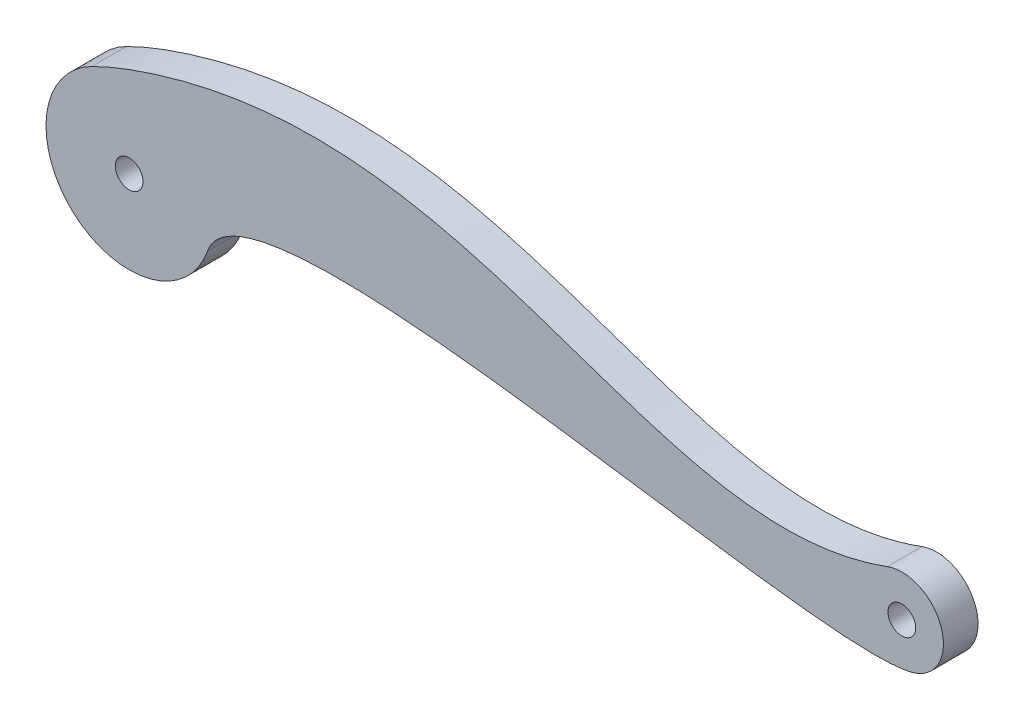
ISO-10303-21;
HEADER;
FILE_DESCRIPTION(('STEP AP214'),'2;1');
FILE_NAME('part.step','',(''),(''),'','','');
FILE_SCHEMA(('AUTOMOTIVE_DESIGN { 1 0 10303 214 1 1 1 1 }'));
ENDSEC;
DATA;
#1=APPLICATION_CONTEXT('core data for automotive mechanical design processes');
#2=APPLICATION_PROTOCOL_DEFINITION('international standard','automotive_design',2000,#1);
#3=PRODUCT_CONTEXT('',#1,'mechanical');
#4=PRODUCT('Part','Part','',(#3));
#5=PRODUCT_RELATED_PRODUCT_CATEGORY('part','',(#4));
#6=PRODUCT_DEFINITION_FORMATION('','',#4);
#7=PRODUCT_DEFINITION_CONTEXT('part definition',#1,'design');
#8=PRODUCT_DEFINITION('design','',#6,#7);
#9=PRODUCT_DEFINITION_SHAPE('','',#8);
#10=(LENGTH_UNIT() NAMED_UNIT(*) SI_UNIT(.MILLI.,.METRE.));
#11=(NAMED_UNIT(*) PLANE_ANGLE_UNIT() SI_UNIT($,.RADIAN.));
#12=(NAMED_UNIT(*) SI_UNIT($,.STERADIAN.) SOLID_ANGLE_UNIT());
#13=UNCERTAINTY_MEASURE_WITH_UNIT(LENGTH_MEASURE(1.E-05),#10,'distance_accuracy_value','');
#14=(GEOMETRIC_REPRESENTATION_CONTEXT(3) GLOBAL_UNCERTAINTY_ASSIGNED_CONTEXT((#13)) GLOBAL_UNIT_ASSIGNED_CONTEXT((#10,
#11,#12)) REPRESENTATION_CONTEXT('',''));
#15=CARTESIAN_POINT('',(0.,0.,0.));
#16=DIRECTION('',(0.,0.,1.));
#17=DIRECTION('',(1.,0.,0.));
#18=AXIS2_PLACEMENT_3D('',#15,#16,#17);
#19=CARTESIAN_POINT('',(-5.38620887722903,10.7232809312663,5.));
#20=CARTESIAN_POINT('',(-2.84461960461294,11.9998986744907,5.));
#21=CARTESIAN_POINT('',(48.946707062239,31.7787395732621,5.));
#22=CARTESIAN_POINT('',(75.6738362485072,-6.86382521144127,5.));
#23=CARTESIAN_POINT('',(109.417114302078,5.62686299543467,5.));
#24=B_SPLINE_CURVE_WITH_KNOTS('',3,(#19,#20,#21,#22,#23),.UNSPECIFIED.,.F.,.F.,(4,1,4),(0.,
0.0365584304062921,0.73116860812584),.UNSPECIFIED.);
#25=DIRECTION('',(0.,0.,-1.));
#26=VECTOR('',#25,1.);
#27=SURFACE_OF_LINEAR_EXTRUSION('',#24,#26);
#28=CARTESIAN_POINT('',(-5.38620887722903,10.7232809312663,0.));
#29=CARTESIAN_POINT('',(-2.84461960461294,11.9998986744907,0.));
#30=CARTESIAN_POINT('',(48.946707062239,31.7787395732621,0.));
#31=CARTESIAN_POINT('',(75.6738362485072,-6.86382521144127,0.));
#32=CARTESIAN_POINT('',(109.417114302078,5.62686299543467,0.));
#33=B_SPLINE_CURVE_WITH_KNOTS('',3,(#28,#29,#30,#31,#32),.UNSPECIFIED.,.F.,.F.,(4,1,4),(0.,
0.0365584304062921,0.73116860812584),.UNSPECIFIED.);
#34=CARTESIAN_POINT('',(-5.38620887722903,10.7232809312663,0.));
#35=VERTEX_POINT('',#34);
#36=CARTESIAN_POINT('',(109.417114302078,5.62686299543466,0.));
#37=VERTEX_POINT('',#36);
#38=EDGE_CURVE('E121',#35,#37,#33,.T.);
#39=ORIENTED_EDGE('',*,*,#38,.F.);
#40=DIRECTION('',(0.,0.,-1.));
#41=VECTOR('',#40,1.);
#42=CARTESIAN_POINT('',(-5.38620887722903,10.7232809312663,5.));
#43=LINE('',#42,#41);
#44=CARTESIAN_POINT('',(-5.38620887722903,10.7232809312663,5.));
#45=VERTEX_POINT('',#44);
#46=EDGE_CURVE('E11',#45,#35,#43,.T.);
#47=ORIENTED_EDGE('',*,*,#46,.F.);
#48=CARTESIAN_POINT('',(109.417114302078,5.62686299543466,5.));
#49=VERTEX_POINT('',#48);
#50=EDGE_CURVE('E90',#45,#49,#24,.T.);
#51=ORIENTED_EDGE('',*,*,#50,.T.);
#52=DIRECTION('',(0.,0.,-1.));
#53=VECTOR('',#52,1.);
#54=CARTESIAN_POINT('',(109.417114302078,5.62686299543466,5.));
#55=LINE('',#54,#53);
#56=EDGE_CURVE('E78',#49,#37,#55,.T.);
#57=ORIENTED_EDGE('',*,*,#56,.T.);
#58=EDGE_LOOP('',(#39,#47,#51,#57));
#59=FACE_BOUND('',#58,.T.);
#60=ADVANCED_FACE('F38',(#59),#27,.T.);
#61=CARTESIAN_POINT('',(0.,0.,5.));
#62=DIRECTION('',(0.,0.,-1.));
#63=DIRECTION('',(-1.,0.,0.));
#64=AXIS2_PLACEMENT_3D('',#61,#62,#63);
#65=CYLINDRICAL_SURFACE('',#64,12.);
#66=CARTESIAN_POINT('',(0.,0.,0.));
#67=DIRECTION('',(0.,0.,1.));
#68=DIRECTION('',(1.,0.,0.));
#69=AXIS2_PLACEMENT_3D('',#66,#67,#68);
#70=CIRCLE('',#69,12.);
#71=CARTESIAN_POINT('',(11.3131134123272,-4.00168276101726,0.));
#72=VERTEX_POINT('',#71);
#73=EDGE_CURVE('E95',#35,#72,#70,.T.);
#74=ORIENTED_EDGE('',*,*,#73,.T.);
#75=DIRECTION('',(0.,0.,-1.));
#76=VECTOR('',#75,1.);
#77=CARTESIAN_POINT('',(11.3131134123272,-4.00168276101726,5.));
#78=LINE('',#77,#76);
#79=CARTESIAN_POINT('',(11.3131134123272,-4.00168276101726,5.));
#80=VERTEX_POINT('',#79);
#81=EDGE_CURVE('E47',#80,#72,#78,.T.);
#82=ORIENTED_EDGE('',*,*,#81,.F.);
#83=CARTESIAN_POINT('',(0.,0.,5.));
#84=DIRECTION('',(0.,0.,1.));
#85=DIRECTION('',(1.,0.,0.));
#86=AXIS2_PLACEMENT_3D('',#83,#84,#85);
#87=CIRCLE('',#86,12.);
#88=EDGE_CURVE('E84',#45,#80,#87,.T.);
#89=ORIENTED_EDGE('',*,*,#88,.F.);
#90=ORIENTED_EDGE('',*,*,#46,.T.);
#91=EDGE_LOOP('',(#74,#82,#89,#90));
#92=FACE_BOUND('',#91,.T.);
#93=ADVANCED_FACE('F93',(#92),#65,.T.);
#94=CARTESIAN_POINT('',(11.3131134123272,-4.00168276101726,5.));
#95=CARTESIAN_POINT('',(17.2885266842697,12.8913425156357,5.));
#96=CARTESIAN_POINT('',(104.266075876487,-11.7074817167264,5.));
#97=CARTESIAN_POINT('',(114.5,-5.19615242270672,5.));
#98=B_SPLINE_CURVE_WITH_KNOTS('',3,(#94,#95,#96,#97),.UNSPECIFIED.,.F.,.F.,(4,4),(0.,
0.83268172178289),.UNSPECIFIED.);
#99=DIRECTION('',(0.,0.,-1.));
#100=VECTOR('',#99,1.);
#101=SURFACE_OF_LINEAR_EXTRUSION('',#98,#100);
#102=CARTESIAN_POINT('',(11.3131134123272,-4.00168276101726,0.));
#103=CARTESIAN_POINT('',(17.2885266842697,12.8913425156357,0.));
#104=CARTESIAN_POINT('',(104.266075876487,-11.7074817167264,0.));
#105=CARTESIAN_POINT('',(114.5,-5.19615242270672,0.));
#106=B_SPLINE_CURVE_WITH_KNOTS('',3,(#102,#103,#104,#105),.UNSPECIFIED.,.F.,.F.,(4,4),(0.,
0.83268172178289),.UNSPECIFIED.);
#107=CARTESIAN_POINT('',(113.168002804461,-5.76348563321793,0.));
#108=VERTEX_POINT('',#107);
#109=EDGE_CURVE('E71',#72,#108,#106,.T.);
#110=ORIENTED_EDGE('',*,*,#109,.T.);
#111=DIRECTION('',(0.,0.,-1.));
#112=VECTOR('',#111,1.);
#113=CARTESIAN_POINT('',(113.168002804461,-5.76348563321793,5.));
#114=LINE('',#113,#112);
#115=CARTESIAN_POINT('',(113.168002804461,-5.76348563321793,5.));
#116=VERTEX_POINT('',#115);
#117=EDGE_CURVE('E96',#116,#108,#114,.T.);
#118=ORIENTED_EDGE('',*,*,#117,.F.);
#119=EDGE_CURVE('E89',#80,#116,#98,.T.);
#120=ORIENTED_EDGE('',*,*,#119,.F.);
#121=ORIENTED_EDGE('',*,*,#81,.T.);
#122=EDGE_LOOP('',(#110,#118,#120,#121));
#123=FACE_BOUND('',#122,.T.);
#124=ADVANCED_FACE('F97',(#123),#101,.F.);
#125=CARTESIAN_POINT('',(0.,0.,5.));
#126=DIRECTION('',(0.,0.,-1.));
#127=DIRECTION('',(-1.,0.,0.));
#128=AXIS2_PLACEMENT_3D('',#125,#126,#127);
#129=CYLINDRICAL_SURFACE('',#128,2.);
#130=CARTESIAN_POINT('',(0.,0.,5.));
#131=DIRECTION('',(0.,0.,1.));
#132=DIRECTION('',(1.,0.,0.));
#133=AXIS2_PLACEMENT_3D('',#130,#131,#132);
#134=CIRCLE('',#133,2.);
#135=CARTESIAN_POINT('',(2.,0.,5.));
#136=VERTEX_POINT('',#135);
#137=EDGE_CURVE('E99',#136,#136,#134,.T.);
#138=ORIENTED_EDGE('',*,*,#137,.T.);
#139=EDGE_LOOP('',(#138));
#140=FACE_BOUND('',#139,.T.);
#141=CARTESIAN_POINT('',(0.,0.,0.));
#142=DIRECTION('',(0.,0.,1.));
#143=DIRECTION('',(1.,0.,0.));
#144=AXIS2_PLACEMENT_3D('',#141,#142,#143);
#145=CIRCLE('',#144,2.);
#146=CARTESIAN_POINT('',(2.,0.,0.));
#147=VERTEX_POINT('',#146);
#148=EDGE_CURVE('E142',#147,#147,#145,.T.);
#149=ORIENTED_EDGE('',*,*,#148,.F.);
#150=EDGE_LOOP('',(#149));
#151=FACE_BOUND('',#150,.T.);
#152=ADVANCED_FACE('F111',(#140,#151),#129,.F.);
#153=CARTESIAN_POINT('',(111.5,0.,5.));
#154=DIRECTION('',(0.,0.,-1.));
#155=DIRECTION('',(-1.,0.,0.));
#156=AXIS2_PLACEMENT_3D('',#153,#154,#155);
#157=CYLINDRICAL_SURFACE('',#156,5.99999999999999);
#158=CARTESIAN_POINT('',(111.5,0.,0.));
#159=DIRECTION('',(0.,0.,1.));
#160=DIRECTION('',(1.,0.,0.));
#161=AXIS2_PLACEMENT_3D('',#158,#159,#160);
#162=CIRCLE('',#161,5.99999999999999);
#163=EDGE_CURVE('E137',#108,#37,#162,.T.);
#164=ORIENTED_EDGE('',*,*,#163,.T.);
#165=ORIENTED_EDGE('',*,*,#56,.F.);
#166=CARTESIAN_POINT('',(111.5,0.,5.));
#167=DIRECTION('',(0.,0.,1.));
#168=DIRECTION('',(1.,0.,0.));
#169=AXIS2_PLACEMENT_3D('',#166,#167,#168);
#170=CIRCLE('',#169,5.99999999999999);
#171=EDGE_CURVE('E55',#116,#49,#170,.T.);
#172=ORIENTED_EDGE('',*,*,#171,.F.);
#173=ORIENTED_EDGE('',*,*,#117,.T.);
#174=EDGE_LOOP('',(#164,#165,#172,#173));
#175=FACE_BOUND('',#174,.T.);
#176=ADVANCED_FACE('F112',(#175),#157,.T.);
#177=CARTESIAN_POINT('',(111.5,0.,5.));
#178=DIRECTION('',(0.,0.,-1.));
#179=DIRECTION('',(-1.,0.,0.));
#180=AXIS2_PLACEMENT_3D('',#177,#178,#179);
#181=CYLINDRICAL_SURFACE('',#180,2.);
#182=CARTESIAN_POINT('',(111.5,0.,5.));
#183=DIRECTION('',(0.,0.,1.));
#184=DIRECTION('',(1.,0.,0.));
#185=AXIS2_PLACEMENT_3D('',#182,#183,#184);
#186=CIRCLE('',#185,2.);
#187=CARTESIAN_POINT('',(113.5,0.,5.));
#188=VERTEX_POINT('',#187);
#189=EDGE_CURVE('E129',#188,#188,#186,.T.);
#190=ORIENTED_EDGE('',*,*,#189,.T.);
#191=EDGE_LOOP('',(#190));
#192=FACE_BOUND('',#191,.T.);
#193=CARTESIAN_POINT('',(111.5,0.,0.));
#194=DIRECTION('',(0.,0.,1.));
#195=DIRECTION('',(1.,0.,0.));
#196=AXIS2_PLACEMENT_3D('',#193,#194,#195);
#197=CIRCLE('',#196,2.);
#198=CARTESIAN_POINT('',(113.5,0.,0.));
#199=VERTEX_POINT('',#198);
#200=EDGE_CURVE('E145',#199,#199,#197,.T.);
#201=ORIENTED_EDGE('',*,*,#200,.F.);
#202=EDGE_LOOP('',(#201));
#203=FACE_BOUND('',#202,.T.);
#204=ADVANCED_FACE('F158',(#192,#203),#181,.F.);
#205=CARTESIAN_POINT('',(0.,0.,5.));
#206=DIRECTION('',(0.,0.,1.));
#207=DIRECTION('',(1.,0.,0.));
#208=AXIS2_PLACEMENT_3D('',#205,#206,#207);
#209=PLANE('',#208);
#210=ORIENTED_EDGE('',*,*,#50,.F.);
#211=ORIENTED_EDGE('',*,*,#88,.T.);
#212=ORIENTED_EDGE('',*,*,#119,.T.);
#213=ORIENTED_EDGE('',*,*,#171,.T.);
#214=EDGE_LOOP('',(#210,#211,#212,#213));
#215=FACE_BOUND('',#214,.T.);
#216=ORIENTED_EDGE('',*,*,#137,.F.);
#217=EDGE_LOOP('',(#216));
#218=FACE_BOUND('',#217,.T.);
#219=ORIENTED_EDGE('',*,*,#189,.F.);
#220=EDGE_LOOP('',(#219));
#221=FACE_BOUND('',#220,.T.);
#222=ADVANCED_FACE('F86',(#215,#218,#221),#209,.T.);
#223=CARTESIAN_POINT('',(0.,0.,0.));
#224=DIRECTION('',(0.,0.,1.));
#225=DIRECTION('',(1.,0.,0.));
#226=AXIS2_PLACEMENT_3D('',#223,#224,#225);
#227=PLANE('',#226);
#228=ORIENTED_EDGE('',*,*,#38,.T.);
#229=ORIENTED_EDGE('',*,*,#163,.F.);
#230=ORIENTED_EDGE('',*,*,#109,.F.);
#231=ORIENTED_EDGE('',*,*,#73,.F.);
#232=EDGE_LOOP('',(#228,#229,#230,#231));
#233=FACE_BOUND('',#232,.T.);
#234=ORIENTED_EDGE('',*,*,#148,.T.);
#235=EDGE_LOOP('',(#234));
#236=FACE_BOUND('',#235,.T.);
#237=ORIENTED_EDGE('',*,*,#200,.T.);
#238=EDGE_LOOP('',(#237));
#239=FACE_BOUND('',#238,.T.);
#240=ADVANCED_FACE('F150',(#233,#236,#239),#227,.F.);
#241=CLOSED_SHELL('',(#60,#93,#124,#152,#176,#204,#222,#240));
#242=MANIFOLD_SOLID_BREP('B2',#241);
#243=ADVANCED_BREP_SHAPE_REPRESENTATION('',(#18,#242),#14);
#244=SHAPE_DEFINITION_REPRESENTATION(#9,#243);
ENDSEC;
END-ISO-10303-21;
